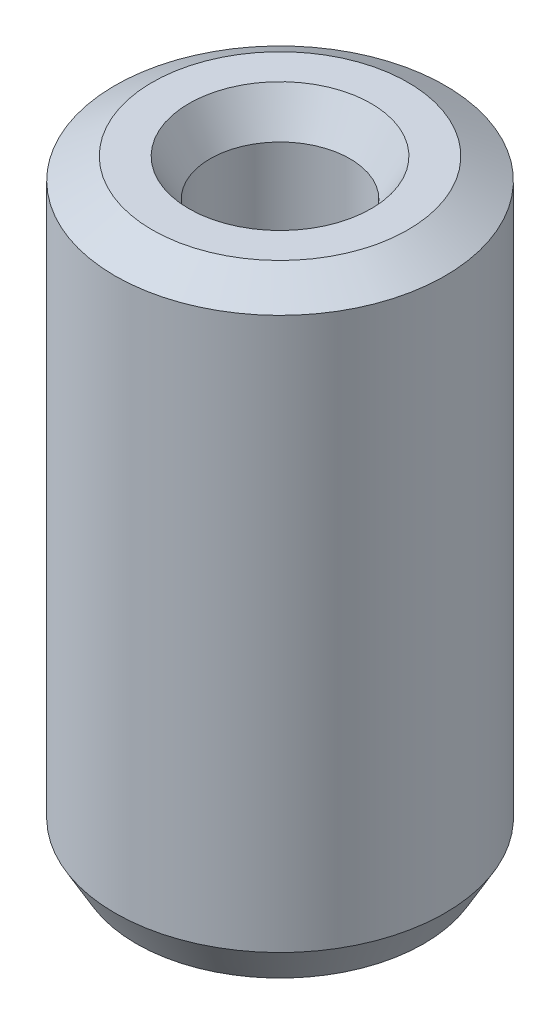
ISO-10303-21;
HEADER;
FILE_DESCRIPTION(('STEP AP214'),'2;1');
FILE_NAME('part.step','',(''),(''),'','','');
FILE_SCHEMA(('AUTOMOTIVE_DESIGN { 1 0 10303 214 1 1 1 1 }'));
ENDSEC;
DATA;
#1=APPLICATION_CONTEXT('core data for automotive mechanical design processes');
#2=APPLICATION_PROTOCOL_DEFINITION('international standard','automotive_design',2000,#1);
#3=PRODUCT_CONTEXT('',#1,'mechanical');
#4=PRODUCT('Part','Part','',(#3));
#5=PRODUCT_RELATED_PRODUCT_CATEGORY('part','',(#4));
#6=PRODUCT_DEFINITION_FORMATION('','',#4);
#7=PRODUCT_DEFINITION_CONTEXT('part definition',#1,'design');
#8=PRODUCT_DEFINITION('design','',#6,#7);
#9=PRODUCT_DEFINITION_SHAPE('','',#8);
#10=(LENGTH_UNIT() NAMED_UNIT(*) SI_UNIT(.MILLI.,.METRE.));
#11=(NAMED_UNIT(*) PLANE_ANGLE_UNIT() SI_UNIT($,.RADIAN.));
#12=(NAMED_UNIT(*) SI_UNIT($,.STERADIAN.) SOLID_ANGLE_UNIT());
#13=UNCERTAINTY_MEASURE_WITH_UNIT(LENGTH_MEASURE(1.E-05),#10,'distance_accuracy_value','');
#14=(GEOMETRIC_REPRESENTATION_CONTEXT(3) GLOBAL_UNCERTAINTY_ASSIGNED_CONTEXT((#13)) GLOBAL_UNIT_ASSIGNED_CONTEXT((#10,
#11,#12)) REPRESENTATION_CONTEXT('',''));
#15=CARTESIAN_POINT('',(0.,0.,0.));
#16=DIRECTION('',(0.,0.,1.));
#17=DIRECTION('',(1.,0.,0.));
#18=AXIS2_PLACEMENT_3D('',#15,#16,#17);
#19=CARTESIAN_POINT('',(0.,18.4905993143347,0.));
#20=DIRECTION('',(0.,-1.,0.));
#21=DIRECTION('',(0.,0.,-1.));
#22=AXIS2_PLACEMENT_3D('',#19,#20,#21);
#23=CYLINDRICAL_SURFACE('',#22,5.);
#24=CARTESIAN_POINT('',(0.,1.12638254451675,0.));
#25=DIRECTION('',(0.,1.,0.));
#26=DIRECTION('',(0.,0.,1.));
#27=AXIS2_PLACEMENT_3D('',#24,#25,#26);
#28=CIRCLE('',#27,5.);
#29=CARTESIAN_POINT('',(0.,1.12638254451675,5.));
#30=VERTEX_POINT('',#29);
#31=EDGE_CURVE('E10',#30,#30,#28,.T.);
#32=ORIENTED_EDGE('',*,*,#31,.T.);
#33=EDGE_LOOP('',(#32));
#34=FACE_BOUND('',#33,.T.);
#35=CARTESIAN_POINT('',(0.,17.8461637107759,0.));
#36=DIRECTION('',(0.,1.,0.));
#37=DIRECTION('',(0.,0.,1.));
#38=AXIS2_PLACEMENT_3D('',#35,#36,#37);
#39=CIRCLE('',#38,5.);
#40=CARTESIAN_POINT('',(0.,17.8461637107759,5.));
#41=VERTEX_POINT('',#40);
#42=EDGE_CURVE('E50',#41,#41,#39,.F.);
#43=ORIENTED_EDGE('',*,*,#42,.T.);
#44=EDGE_LOOP('',(#43));
#45=FACE_BOUND('',#44,.T.);
#46=ADVANCED_FACE('F39',(#34,#45),#23,.T.);
#47=CARTESIAN_POINT('',(0.,18.4905993143347,0.));
#48=DIRECTION('',(0.,1.,0.));
#49=DIRECTION('',(0.,0.,1.));
#50=AXIS2_PLACEMENT_3D('',#47,#48,#49);
#51=PLANE('',#50);
#52=CARTESIAN_POINT('',(0.,18.4905993143347,0.));
#53=DIRECTION('',(0.,1.,0.));
#54=DIRECTION('',(0.,0.,1.));
#55=AXIS2_PLACEMENT_3D('',#52,#53,#54);
#56=CIRCLE('',#55,2.76230083852591);
#57=CARTESIAN_POINT('',(0.,18.4905993143347,2.76230083852591));
#58=VERTEX_POINT('',#57);
#59=EDGE_CURVE('E58',#58,#58,#56,.F.);
#60=ORIENTED_EDGE('',*,*,#59,.T.);
#61=EDGE_LOOP('',(#60));
#62=FACE_BOUND('',#61,.T.);
#63=CARTESIAN_POINT('',(0.,18.4905993143347,0.));
#64=DIRECTION('',(0.,1.,0.));
#65=DIRECTION('',(0.,0.,1.));
#66=AXIS2_PLACEMENT_3D('',#63,#64,#65);
#67=CIRCLE('',#66,3.87361745548325);
#68=CARTESIAN_POINT('',(0.,18.4905993143347,3.87361745548325));
#69=VERTEX_POINT('',#68);
#70=EDGE_CURVE('E61',#69,#69,#67,.T.);
#71=ORIENTED_EDGE('',*,*,#70,.T.);
#72=EDGE_LOOP('',(#71));
#73=FACE_BOUND('',#72,.T.);
#74=ADVANCED_FACE('F88',(#62,#73),#51,.T.);
#75=CARTESIAN_POINT('',(0.,0.,0.));
#76=DIRECTION('',(0.,1.,0.));
#77=DIRECTION('',(0.,0.,1.));
#78=AXIS2_PLACEMENT_3D('',#75,#76,#77);
#79=PLANE('',#78);
#80=CARTESIAN_POINT('',(0.,0.,0.));
#81=DIRECTION('',(0.,1.,0.));
#82=DIRECTION('',(0.,0.,1.));
#83=AXIS2_PLACEMENT_3D('',#80,#81,#82);
#84=CIRCLE('',#83,3.2442477794839);
#85=CARTESIAN_POINT('',(0.,0.,3.2442477794839));
#86=VERTEX_POINT('',#85);
#87=EDGE_CURVE('E51',#86,#86,#84,.T.);
#88=ORIENTED_EDGE('',*,*,#87,.T.);
#89=EDGE_LOOP('',(#88));
#90=FACE_BOUND('',#89,.T.);
#91=CARTESIAN_POINT('',(0.,0.,0.));
#92=DIRECTION('',(0.,1.,0.));
#93=DIRECTION('',(0.,0.,1.));
#94=AXIS2_PLACEMENT_3D('',#91,#92,#93);
#95=CIRCLE('',#94,4.35556439644126);
#96=CARTESIAN_POINT('',(0.,0.,4.35556439644126));
#97=VERTEX_POINT('',#96);
#98=EDGE_CURVE('E54',#97,#97,#95,.F.);
#99=ORIENTED_EDGE('',*,*,#98,.T.);
#100=EDGE_LOOP('',(#99));
#101=FACE_BOUND('',#100,.T.);
#102=ADVANCED_FACE('F83',(#90,#101),#79,.F.);
#103=CARTESIAN_POINT('',(0.,18.4905993143347,0.));
#104=DIRECTION('',(0.,-1.,0.));
#105=DIRECTION('',(0.,0.,-1.));
#106=AXIS2_PLACEMENT_3D('',#103,#104,#105);
#107=CYLINDRICAL_SURFACE('',#106,2.11786523496716);
#108=CARTESIAN_POINT('',(0.,17.3642167698179,0.));
#109=DIRECTION('',(0.,1.,0.));
#110=DIRECTION('',(0.,0.,1.));
#111=AXIS2_PLACEMENT_3D('',#108,#109,#110);
#112=CIRCLE('',#111,2.11786523496716);
#113=CARTESIAN_POINT('',(0.,17.3642167698179,2.11786523496716));
#114=VERTEX_POINT('',#113);
#115=EDGE_CURVE('E67',#114,#114,#112,.T.);
#116=ORIENTED_EDGE('',*,*,#115,.T.);
#117=EDGE_LOOP('',(#116));
#118=FACE_BOUND('',#117,.T.);
#119=CARTESIAN_POINT('',(0.,0.64443560355874,0.));
#120=DIRECTION('',(0.,1.,0.));
#121=DIRECTION('',(0.,0.,1.));
#122=AXIS2_PLACEMENT_3D('',#119,#120,#121);
#123=CIRCLE('',#122,2.11786523496716);
#124=CARTESIAN_POINT('',(0.,0.64443560355874,2.11786523496716));
#125=VERTEX_POINT('',#124);
#126=EDGE_CURVE('E69',#125,#125,#123,.F.);
#127=ORIENTED_EDGE('',*,*,#126,.T.);
#128=EDGE_LOOP('',(#127));
#129=FACE_BOUND('',#128,.T.);
#130=ADVANCED_FACE('F71',(#118,#129),#107,.F.);
#131=CARTESIAN_POINT('',(0.,17.3642167698179,0.));
#132=DIRECTION('',(0.,1.,0.));
#133=DIRECTION('',(0.,0.,1.));
#134=AXIS2_PLACEMENT_3D('',#131,#132,#133);
#135=CONICAL_SURFACE('',#134,2.11786523496716,0.51967362568395);
#136=ORIENTED_EDGE('',*,*,#59,.F.);
#137=EDGE_LOOP('',(#136));
#138=FACE_BOUND('',#137,.T.);
#139=ORIENTED_EDGE('',*,*,#115,.F.);
#140=EDGE_LOOP('',(#139));
#141=FACE_BOUND('',#140,.T.);
#142=ADVANCED_FACE('F77',(#138,#141),#135,.F.);
#143=CARTESIAN_POINT('',(0.,0.,0.));
#144=DIRECTION('',(0.,-1.,0.));
#145=DIRECTION('',(0.,0.,-1.));
#146=AXIS2_PLACEMENT_3D('',#143,#144,#145);
#147=CONICAL_SURFACE('',#146,3.2442477794839,1.05112270111095);
#148=ORIENTED_EDGE('',*,*,#126,.F.);
#149=EDGE_LOOP('',(#148));
#150=FACE_BOUND('',#149,.T.);
#151=ORIENTED_EDGE('',*,*,#87,.F.);
#152=EDGE_LOOP('',(#151));
#153=FACE_BOUND('',#152,.T.);
#154=ADVANCED_FACE('F73',(#150,#153),#147,.F.);
#155=CARTESIAN_POINT('',(0.,1.12638254451675,0.));
#156=DIRECTION('',(0.,1.,0.));
#157=DIRECTION('',(0.,0.,1.));
#158=AXIS2_PLACEMENT_3D('',#155,#156,#157);
#159=CONICAL_SURFACE('',#158,5.,0.519673625683947);
#160=ORIENTED_EDGE('',*,*,#98,.F.);
#161=EDGE_LOOP('',(#160));
#162=FACE_BOUND('',#161,.T.);
#163=ORIENTED_EDGE('',*,*,#31,.F.);
#164=EDGE_LOOP('',(#163));
#165=FACE_BOUND('',#164,.T.);
#166=ADVANCED_FACE('F76',(#162,#165),#159,.T.);
#167=CARTESIAN_POINT('',(0.,18.4905993143347,0.));
#168=DIRECTION('',(0.,-1.,0.));
#169=DIRECTION('',(0.,0.,-1.));
#170=AXIS2_PLACEMENT_3D('',#167,#168,#169);
#171=CONICAL_SURFACE('',#170,3.87361745548325,1.05112270111095);
#172=ORIENTED_EDGE('',*,*,#42,.F.);
#173=EDGE_LOOP('',(#172));
#174=FACE_BOUND('',#173,.T.);
#175=ORIENTED_EDGE('',*,*,#70,.F.);
#176=EDGE_LOOP('',(#175));
#177=FACE_BOUND('',#176,.T.);
#178=ADVANCED_FACE('F45',(#174,#177),#171,.T.);
#179=CLOSED_SHELL('',(#46,#74,#102,#130,#142,#154,#166,#178));
#180=MANIFOLD_SOLID_BREP('B2',#179);
#181=ADVANCED_BREP_SHAPE_REPRESENTATION('',(#18,#180),#14);
#182=SHAPE_DEFINITION_REPRESENTATION(#9,#181);
ENDSEC;
END-ISO-10303-21;
